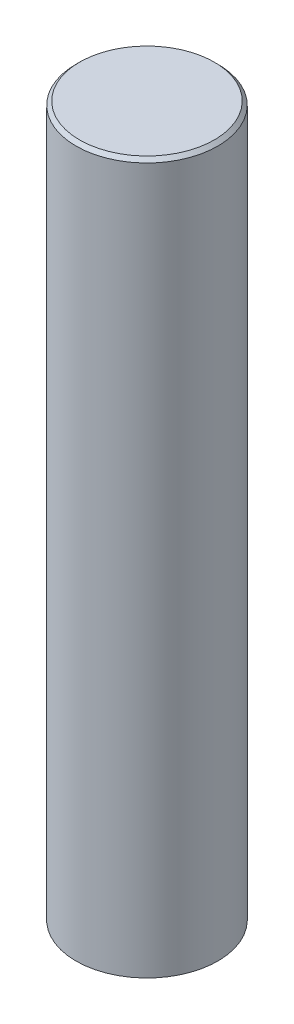
ISO-10303-21;
HEADER;
FILE_DESCRIPTION(('STEP AP214'),'2;1');
FILE_NAME('part.step','',(''),(''),'','','');
FILE_SCHEMA(('AUTOMOTIVE_DESIGN { 1 0 10303 214 1 1 1 1 }'));
ENDSEC;
DATA;
#1=APPLICATION_CONTEXT('core data for automotive mechanical design processes');
#2=APPLICATION_PROTOCOL_DEFINITION('international standard','automotive_design',2000,#1);
#3=PRODUCT_CONTEXT('',#1,'mechanical');
#4=PRODUCT('Part','Part','',(#3));
#5=PRODUCT_RELATED_PRODUCT_CATEGORY('part','',(#4));
#6=PRODUCT_DEFINITION_FORMATION('','',#4);
#7=PRODUCT_DEFINITION_CONTEXT('part definition',#1,'design');
#8=PRODUCT_DEFINITION('design','',#6,#7);
#9=PRODUCT_DEFINITION_SHAPE('','',#8);
#10=(LENGTH_UNIT() NAMED_UNIT(*) SI_UNIT(.MILLI.,.METRE.));
#11=(NAMED_UNIT(*) PLANE_ANGLE_UNIT() SI_UNIT($,.RADIAN.));
#12=(NAMED_UNIT(*) SI_UNIT($,.STERADIAN.) SOLID_ANGLE_UNIT());
#13=UNCERTAINTY_MEASURE_WITH_UNIT(LENGTH_MEASURE(1.E-05),#10,'distance_accuracy_value','');
#14=(GEOMETRIC_REPRESENTATION_CONTEXT(3) GLOBAL_UNCERTAINTY_ASSIGNED_CONTEXT((#13)) GLOBAL_UNIT_ASSIGNED_CONTEXT((#10,
#11,#12)) REPRESENTATION_CONTEXT('',''));
#15=CARTESIAN_POINT('',(0.,0.,0.));
#16=DIRECTION('',(0.,0.,1.));
#17=DIRECTION('',(1.,0.,0.));
#18=AXIS2_PLACEMENT_3D('',#15,#16,#17);
#19=CARTESIAN_POINT('',(0.,200.,0.));
#20=DIRECTION('',(0.,-1.,0.));
#21=DIRECTION('',(0.,0.,-1.));
#22=AXIS2_PLACEMENT_3D('',#19,#20,#21);
#23=CYLINDRICAL_SURFACE('',#22,20.);
#24=CARTESIAN_POINT('',(0.,199.,0.));
#25=DIRECTION('',(0.,1.,0.));
#26=DIRECTION('',(0.,0.,1.));
#27=AXIS2_PLACEMENT_3D('',#24,#25,#26);
#28=CIRCLE('',#27,20.);
#29=CARTESIAN_POINT('',(0.,199.,20.));
#30=VERTEX_POINT('',#29);
#31=EDGE_CURVE('E10',#30,#30,#28,.F.);
#32=ORIENTED_EDGE('',*,*,#31,.T.);
#33=EDGE_LOOP('',(#32));
#34=FACE_BOUND('',#33,.T.);
#35=CARTESIAN_POINT('',(0.,0.,0.));
#36=DIRECTION('',(0.,1.,0.));
#37=DIRECTION('',(0.,0.,1.));
#38=AXIS2_PLACEMENT_3D('',#35,#36,#37);
#39=CIRCLE('',#38,20.);
#40=CARTESIAN_POINT('',(0.,0.,20.));
#41=VERTEX_POINT('',#40);
#42=EDGE_CURVE('E42',#41,#41,#39,.T.);
#43=ORIENTED_EDGE('',*,*,#42,.T.);
#44=EDGE_LOOP('',(#43));
#45=FACE_BOUND('',#44,.T.);
#46=ADVANCED_FACE('F31',(#34,#45),#23,.T.);
#47=CARTESIAN_POINT('',(0.,200.,0.));
#48=DIRECTION('',(0.,1.,0.));
#49=DIRECTION('',(0.,0.,1.));
#50=AXIS2_PLACEMENT_3D('',#47,#48,#49);
#51=PLANE('',#50);
#52=CARTESIAN_POINT('',(0.,200.,0.));
#53=DIRECTION('',(0.,1.,0.));
#54=DIRECTION('',(0.,0.,1.));
#55=AXIS2_PLACEMENT_3D('',#52,#53,#54);
#56=CIRCLE('',#55,19.);
#57=CARTESIAN_POINT('',(0.,200.,19.));
#58=VERTEX_POINT('',#57);
#59=EDGE_CURVE('E38',#58,#58,#56,.T.);
#60=ORIENTED_EDGE('',*,*,#59,.T.);
#61=EDGE_LOOP('',(#60));
#62=FACE_BOUND('',#61,.T.);
#63=ADVANCED_FACE('F52',(#62),#51,.T.);
#64=CARTESIAN_POINT('',(0.,0.,0.));
#65=DIRECTION('',(0.,1.,0.));
#66=DIRECTION('',(0.,0.,1.));
#67=AXIS2_PLACEMENT_3D('',#64,#65,#66);
#68=PLANE('',#67);
#69=ORIENTED_EDGE('',*,*,#42,.F.);
#70=EDGE_LOOP('',(#69));
#71=FACE_BOUND('',#70,.T.);
#72=ADVANCED_FACE('F50',(#71),#68,.F.);
#73=CARTESIAN_POINT('',(0.,200.,0.));
#74=DIRECTION('',(0.,-1.,0.));
#75=DIRECTION('',(0.,0.,-1.));
#76=AXIS2_PLACEMENT_3D('',#73,#74,#75);
#77=CONICAL_SURFACE('',#76,19.,0.785398163397438);
#78=ORIENTED_EDGE('',*,*,#31,.F.);
#79=EDGE_LOOP('',(#78));
#80=FACE_BOUND('',#79,.T.);
#81=ORIENTED_EDGE('',*,*,#59,.F.);
#82=EDGE_LOOP('',(#81));
#83=FACE_BOUND('',#82,.T.);
#84=ADVANCED_FACE('F33',(#80,#83),#77,.T.);
#85=CLOSED_SHELL('',(#46,#63,#72,#84));
#86=MANIFOLD_SOLID_BREP('B2',#85);
#87=ADVANCED_BREP_SHAPE_REPRESENTATION('',(#18,#86),#14);
#88=SHAPE_DEFINITION_REPRESENTATION(#9,#87);
ENDSEC;
END-ISO-10303-21;
